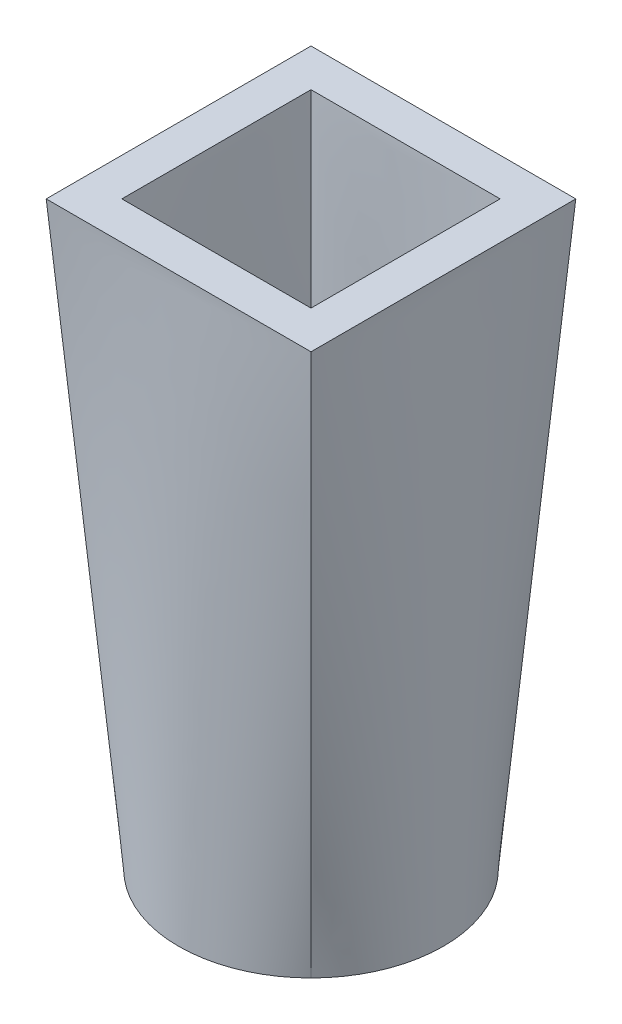
ISO-10303-21;
HEADER;
FILE_DESCRIPTION(('STEP AP214'),'2;1');
FILE_NAME('part.step','',(''),(''),'','','');
FILE_SCHEMA(('AUTOMOTIVE_DESIGN { 1 0 10303 214 1 1 1 1 }'));
ENDSEC;
DATA;
#1=APPLICATION_CONTEXT('core data for automotive mechanical design processes');
#2=APPLICATION_PROTOCOL_DEFINITION('international standard','automotive_design',2000,#1);
#3=PRODUCT_CONTEXT('',#1,'mechanical');
#4=PRODUCT('Part','Part','',(#3));
#5=PRODUCT_RELATED_PRODUCT_CATEGORY('part','',(#4));
#6=PRODUCT_DEFINITION_FORMATION('','',#4);
#7=PRODUCT_DEFINITION_CONTEXT('part definition',#1,'design');
#8=PRODUCT_DEFINITION('design','',#6,#7);
#9=PRODUCT_DEFINITION_SHAPE('','',#8);
#10=(LENGTH_UNIT() NAMED_UNIT(*) SI_UNIT(.MILLI.,.METRE.));
#11=(NAMED_UNIT(*) PLANE_ANGLE_UNIT() SI_UNIT($,.RADIAN.));
#12=(NAMED_UNIT(*) SI_UNIT($,.STERADIAN.) SOLID_ANGLE_UNIT());
#13=UNCERTAINTY_MEASURE_WITH_UNIT(LENGTH_MEASURE(1.E-05),#10,'distance_accuracy_value','');
#14=(GEOMETRIC_REPRESENTATION_CONTEXT(3) GLOBAL_UNCERTAINTY_ASSIGNED_CONTEXT((#13)) GLOBAL_UNIT_ASSIGNED_CONTEXT((#10,
#11,#12)) REPRESENTATION_CONTEXT('',''));
#15=CARTESIAN_POINT('',(0.,0.,0.));
#16=DIRECTION('',(0.,0.,1.));
#17=DIRECTION('',(1.,0.,0.));
#18=AXIS2_PLACEMENT_3D('',#15,#16,#17);
#19=CARTESIAN_POINT('',(0.,153.617019002257,0.));
#20=DIRECTION('',(0.,1.,0.));
#21=DIRECTION('',(0.,0.,1.));
#22=AXIS2_PLACEMENT_3D('',#19,#20,#21);
#23=PLANE('',#22);
#24=DIRECTION('',(1.,0.,0.));
#25=VECTOR('',#24,1.);
#26=CARTESIAN_POINT('',(-25.,153.617019002257,25.));
#27=LINE('',#26,#25);
#28=CARTESIAN_POINT('',(-25.,153.617019002257,25.));
#29=VERTEX_POINT('',#28);
#30=CARTESIAN_POINT('',(25.,153.617019002257,25.));
#31=VERTEX_POINT('',#30);
#32=EDGE_CURVE('E293',#29,#31,#27,.T.);
#33=ORIENTED_EDGE('',*,*,#32,.F.);
#34=DIRECTION('',(0.,0.,-1.));
#35=VECTOR('',#34,1.);
#36=CARTESIAN_POINT('',(-25.,153.617019002257,25.));
#37=LINE('',#36,#35);
#38=CARTESIAN_POINT('',(-25.,153.617019002257,-25.));
#39=VERTEX_POINT('',#38);
#40=EDGE_CURVE('E179',#29,#39,#37,.T.);
#41=ORIENTED_EDGE('',*,*,#40,.T.);
#42=DIRECTION('',(1.,0.,0.));
#43=VECTOR('',#42,1.);
#44=CARTESIAN_POINT('',(-25.,153.617019002257,-25.));
#45=LINE('',#44,#43);
#46=CARTESIAN_POINT('',(25.,153.617019002257,-25.));
#47=VERTEX_POINT('',#46);
#48=EDGE_CURVE('E265',#39,#47,#45,.T.);
#49=ORIENTED_EDGE('',*,*,#48,.T.);
#50=DIRECTION('',(0.,0.,-1.));
#51=VECTOR('',#50,1.);
#52=CARTESIAN_POINT('',(25.,153.617019002257,25.));
#53=LINE('',#52,#51);
#54=EDGE_CURVE('E95',#31,#47,#53,.T.);
#55=ORIENTED_EDGE('',*,*,#54,.F.);
#56=EDGE_LOOP('',(#33,#41,#49,#55));
#57=FACE_BOUND('',#56,.T.);
#58=DIRECTION('',(1.,0.,0.));
#59=VECTOR('',#58,1.);
#60=CARTESIAN_POINT('',(-35.,153.617019002257,35.));
#61=LINE('',#60,#59);
#62=CARTESIAN_POINT('',(-35.,153.617019002257,35.));
#63=VERTEX_POINT('',#62);
#64=CARTESIAN_POINT('',(35.,153.617019002257,35.));
#65=VERTEX_POINT('',#64);
#66=EDGE_CURVE('E172',#63,#65,#61,.T.);
#67=ORIENTED_EDGE('',*,*,#66,.T.);
#68=DIRECTION('',(0.,0.,-1.));
#69=VECTOR('',#68,1.);
#70=CARTESIAN_POINT('',(35.,153.617019002257,35.));
#71=LINE('',#70,#69);
#72=CARTESIAN_POINT('',(35.,153.617019002257,-35.));
#73=VERTEX_POINT('',#72);
#74=EDGE_CURVE('E395',#65,#73,#71,.T.);
#75=ORIENTED_EDGE('',*,*,#74,.T.);
#76=DIRECTION('',(1.,0.,0.));
#77=VECTOR('',#76,1.);
#78=CARTESIAN_POINT('',(-35.,153.617019002257,-35.));
#79=LINE('',#78,#77);
#80=CARTESIAN_POINT('',(-35.,153.617019002257,-35.));
#81=VERTEX_POINT('',#80);
#82=EDGE_CURVE('E422',#81,#73,#79,.T.);
#83=ORIENTED_EDGE('',*,*,#82,.F.);
#84=DIRECTION('',(0.,0.,-1.));
#85=VECTOR('',#84,1.);
#86=CARTESIAN_POINT('',(-35.,153.617019002257,35.));
#87=LINE('',#86,#85);
#88=EDGE_CURVE('E350',#63,#81,#87,.T.);
#89=ORIENTED_EDGE('',*,*,#88,.F.);
#90=EDGE_LOOP('',(#67,#75,#83,#89));
#91=FACE_BOUND('',#90,.T.);
#92=ADVANCED_FACE('F91',(#57,#91),#23,.T.);
#93=CARTESIAN_POINT('',(0.,0.,0.));
#94=DIRECTION('',(0.,1.,0.));
#95=DIRECTION('',(0.,0.,1.));
#96=AXIS2_PLACEMENT_3D('',#93,#94,#95);
#97=PLANE('',#96);
#98=CARTESIAN_POINT('',(0.,0.,0.));
#99=DIRECTION('',(0.,1.,0.));
#100=DIRECTION('',(0.,0.,1.));
#101=AXIS2_PLACEMENT_3D('',#98,#99,#100);
#102=CIRCLE('',#101,25.);
#103=CARTESIAN_POINT('',(-17.6776695296637,0.,-17.6776695296637));
#104=VERTEX_POINT('',#103);
#105=CARTESIAN_POINT('',(-17.6776695296637,0.,17.6776695296637));
#106=VERTEX_POINT('',#105);
#107=EDGE_CURVE('E117',#104,#106,#102,.T.);
#108=ORIENTED_EDGE('',*,*,#107,.T.);
#109=CARTESIAN_POINT('',(17.6776695296637,0.,17.6776695296637));
#110=VERTEX_POINT('',#109);
#111=EDGE_CURVE('E161',#106,#110,#102,.T.);
#112=ORIENTED_EDGE('',*,*,#111,.T.);
#113=CARTESIAN_POINT('',(17.6776695296637,0.,-17.6776695296637));
#114=VERTEX_POINT('',#113);
#115=EDGE_CURVE('E173',#110,#114,#102,.T.);
#116=ORIENTED_EDGE('',*,*,#115,.T.);
#117=EDGE_CURVE('E187',#114,#104,#102,.T.);
#118=ORIENTED_EDGE('',*,*,#117,.T.);
#119=EDGE_LOOP('',(#108,#112,#116,#118));
#120=FACE_BOUND('',#119,.T.);
#121=CARTESIAN_POINT('',(0.,0.,0.));
#122=DIRECTION('',(0.,1.,0.));
#123=DIRECTION('',(0.,0.,1.));
#124=AXIS2_PLACEMENT_3D('',#121,#122,#123);
#125=CIRCLE('',#124,35.);
#126=CARTESIAN_POINT('',(-24.7487373415292,0.,24.7487373415292));
#127=VERTEX_POINT('',#126);
#128=CARTESIAN_POINT('',(24.7487373415292,0.,24.7487373415292));
#129=VERTEX_POINT('',#128);
#130=EDGE_CURVE('E12',#127,#129,#125,.T.);
#131=ORIENTED_EDGE('',*,*,#130,.F.);
#132=CARTESIAN_POINT('',(-24.7487373415292,0.,-24.7487373415292));
#133=VERTEX_POINT('',#132);
#134=EDGE_CURVE('E320',#133,#127,#125,.T.);
#135=ORIENTED_EDGE('',*,*,#134,.F.);
#136=CARTESIAN_POINT('',(24.7487373415292,0.,-24.7487373415292));
#137=VERTEX_POINT('',#136);
#138=EDGE_CURVE('E321',#137,#133,#125,.T.);
#139=ORIENTED_EDGE('',*,*,#138,.F.);
#140=EDGE_CURVE('E101',#129,#137,#125,.T.);
#141=ORIENTED_EDGE('',*,*,#140,.F.);
#142=EDGE_LOOP('',(#131,#135,#139,#141));
#143=FACE_BOUND('',#142,.T.);
#144=ADVANCED_FACE('F185',(#120,#143),#97,.F.);
#145=CARTESIAN_POINT('',(-24.7487373415292,0.,24.7487373415292));
#146=CARTESIAN_POINT('',(-35.,153.617019002257,35.));
#147=CARTESIAN_POINT('',(-23.2904040081958,0.,26.2070706748625));
#148=CARTESIAN_POINT('',(-32.0833333333333,153.617019002257,35.));
#149=CARTESIAN_POINT('',(-21.6478916843896,0.,27.5902980372642));
#150=CARTESIAN_POINT('',(-29.1666666666667,153.617019002257,35.));
#151=CARTESIAN_POINT('',(-18.016529314503,0.,30.0875461216727));
#152=CARTESIAN_POINT('',(-23.3333333333333,153.617019002257,35.));
#153=CARTESIAN_POINT('',(-16.0274938237574,0.,31.20075829867));
#154=CARTESIAN_POINT('',(-20.4166666666666,153.617019002257,35.));
#155=CARTESIAN_POINT('',(-11.7749205011776,0.,33.041173161278));
#156=CARTESIAN_POINT('',(-14.5833333333333,153.617019002257,35.));
#157=CARTESIAN_POINT('',(-9.51171560693949,0.,33.7674737720229));
#158=CARTESIAN_POINT('',(-11.6666666666666,153.617019002257,35.));
#159=CARTESIAN_POINT('',(-4.83194760493549,0.,34.7471912688595));
#160=CARTESIAN_POINT('',(-5.8333333333333,153.617019002257,35.));
#161=CARTESIAN_POINT('',(-2.41624578050973,0.,35.));
#162=CARTESIAN_POINT('',(-2.91666666666664,153.617019002257,35.));
#163=CARTESIAN_POINT('',(2.41624578050972,0.,35.));
#164=CARTESIAN_POINT('',(2.9166666666667,153.617019002257,35.));
#165=CARTESIAN_POINT('',(4.83194760493548,0.,34.7471912688595));
#166=CARTESIAN_POINT('',(5.83333333333337,153.617019002257,35.));
#167=CARTESIAN_POINT('',(9.51171560693949,0.,33.7674737720229));
#168=CARTESIAN_POINT('',(11.6666666666667,153.617019002257,35.));
#169=CARTESIAN_POINT('',(11.7749205011775,0.,33.041173161278));
#170=CARTESIAN_POINT('',(14.5833333333334,153.617019002257,35.));
#171=CARTESIAN_POINT('',(16.0274938237574,0.,31.20075829867));
#172=CARTESIAN_POINT('',(20.4166666666667,153.617019002257,35.));
#173=CARTESIAN_POINT('',(18.016529314503,0.,30.0875461216727));
#174=CARTESIAN_POINT('',(23.3333333333334,153.617019002257,35.));
#175=CARTESIAN_POINT('',(21.6478916843896,0.,27.5902980372642));
#176=CARTESIAN_POINT('',(29.1666666666667,153.617019002257,35.));
#177=CARTESIAN_POINT('',(23.2904040081958,0.,26.2070706748625));
#178=CARTESIAN_POINT('',(32.0833333333333,153.617019002257,35.));
#179=CARTESIAN_POINT('',(24.7487373415292,0.,24.7487373415292));
#180=CARTESIAN_POINT('',(35.,153.617019002257,35.));
#181=B_SPLINE_SURFACE_WITH_KNOTS('',3,1,((#145,#146),(#147,#148),(#149,#150),(#151,#152),(#153,
#154),(#155,#156),(#157,#158),(#159,#160),(#161,#162),(#163,#164),(#165,#166),(#167,#168),(#169,
#170),(#171,#172),(#173,#174),(#175,#176),(#177,#178),(#179,#180)),.UNSPECIFIED.,.F.,.F.,.F.,(4,
2,2,2,2,2,2,2,4),(2,2),(0.,0.125,0.25,0.375,0.5,0.625,0.75,0.875,1.),(0.,1.),.UNSPECIFIED.);
#182=DIRECTION('',(0.0664373914767899,0.995576288401607,0.0664373914767898));
#183=VECTOR('',#182,1.);
#184=CARTESIAN_POINT('',(29.8743686707646,76.8085095011283,29.8743686707646));
#185=LINE('',#184,#183);
#186=EDGE_CURVE('E330',#129,#65,#185,.T.);
#187=DIRECTION('',(0.0664373914767897,-0.995576288401607,-0.0664373914767899));
#188=VECTOR('',#187,1.);
#189=CARTESIAN_POINT('',(-29.8743686707646,76.8085095011283,29.8743686707646));
#190=LINE('',#189,#188);
#191=EDGE_CURVE('E336',#63,#127,#190,.T.);
#192=ORIENTED_EDGE('',*,*,#130,.T.);
#193=ORIENTED_EDGE('',*,*,#186,.T.);
#194=ORIENTED_EDGE('',*,*,#66,.F.);
#195=ORIENTED_EDGE('',*,*,#191,.T.);
#196=EDGE_LOOP('',(#192,#193,#194,#195));
#197=FACE_BOUND('',#196,.T.);
#198=ADVANCED_FACE('F208',(#197),#181,.T.);
#199=CARTESIAN_POINT('',(24.7487373415292,0.,24.7487373415292));
#200=CARTESIAN_POINT('',(35.,153.617019002257,35.));
#201=CARTESIAN_POINT('',(26.2070706748625,0.,23.2904040081958));
#202=CARTESIAN_POINT('',(35.,153.617019002257,32.0833333333333));
#203=CARTESIAN_POINT('',(27.5902980372642,0.,21.6478916843896));
#204=CARTESIAN_POINT('',(35.,153.617019002257,29.1666666666667));
#205=CARTESIAN_POINT('',(30.0875461216727,0.,18.016529314503));
#206=CARTESIAN_POINT('',(35.,153.617019002257,23.3333333333333));
#207=CARTESIAN_POINT('',(31.20075829867,0.,16.0274938237574));
#208=CARTESIAN_POINT('',(35.,153.617019002257,20.4166666666667));
#209=CARTESIAN_POINT('',(33.041173161278,0.,11.7749205011775));
#210=CARTESIAN_POINT('',(35.,153.617019002257,14.5833333333333));
#211=CARTESIAN_POINT('',(33.7674737720229,0.,9.51171560693949));
#212=CARTESIAN_POINT('',(35.,153.617019002257,11.6666666666666));
#213=CARTESIAN_POINT('',(34.7471912688595,0.,4.83194760493549));
#214=CARTESIAN_POINT('',(35.,153.617019002257,5.83333333333331));
#215=CARTESIAN_POINT('',(35.,0.,2.41624578050972));
#216=CARTESIAN_POINT('',(35.,153.617019002257,2.91666666666664));
#217=CARTESIAN_POINT('',(35.,0.,-2.41624578050972));
#218=CARTESIAN_POINT('',(35.,153.617019002257,-2.91666666666669));
#219=CARTESIAN_POINT('',(34.7471912688595,0.,-4.83194760493548));
#220=CARTESIAN_POINT('',(35.,153.617019002257,-5.83333333333336));
#221=CARTESIAN_POINT('',(33.7674737720228,0.,-9.51171560693948));
#222=CARTESIAN_POINT('',(35.,153.617019002257,-11.6666666666667));
#223=CARTESIAN_POINT('',(33.041173161278,0.,-11.7749205011775));
#224=CARTESIAN_POINT('',(35.,153.617019002257,-14.5833333333334));
#225=CARTESIAN_POINT('',(31.20075829867,0.,-16.0274938237574));
#226=CARTESIAN_POINT('',(35.,153.617019002257,-20.4166666666667));
#227=CARTESIAN_POINT('',(30.0875461216727,0.,-18.016529314503));
#228=CARTESIAN_POINT('',(35.,153.617019002257,-23.3333333333334));
#229=CARTESIAN_POINT('',(27.5902980372642,0.,-21.6478916843896));
#230=CARTESIAN_POINT('',(35.,153.617019002257,-29.1666666666667));
#231=CARTESIAN_POINT('',(26.2070706748625,0.,-23.2904040081958));
#232=CARTESIAN_POINT('',(35.,153.617019002257,-32.0833333333333));
#233=CARTESIAN_POINT('',(24.7487373415292,0.,-24.7487373415292));
#234=CARTESIAN_POINT('',(35.,153.617019002257,-35.));
#235=B_SPLINE_SURFACE_WITH_KNOTS('',3,1,((#199,#200),(#201,#202),(#203,#204),(#205,#206),(#207,
#208),(#209,#210),(#211,#212),(#213,#214),(#215,#216),(#217,#218),(#219,#220),(#221,#222),(#223,
#224),(#225,#226),(#227,#228),(#229,#230),(#231,#232),(#233,#234)),.UNSPECIFIED.,.F.,.F.,.F.,(4,
2,2,2,2,2,2,2,4),(2,2),(0.,0.125,0.25,0.375,0.5,0.625,0.75,0.875,1.),(0.,1.),.UNSPECIFIED.);
#236=DIRECTION('',(0.0664373914767899,0.995576288401607,-0.0664373914767898));
#237=VECTOR('',#236,1.);
#238=CARTESIAN_POINT('',(29.8743686707646,76.8085095011283,-29.8743686707646));
#239=LINE('',#238,#237);
#240=EDGE_CURVE('E341',#137,#73,#239,.T.);
#241=ORIENTED_EDGE('',*,*,#140,.T.);
#242=ORIENTED_EDGE('',*,*,#240,.T.);
#243=ORIENTED_EDGE('',*,*,#74,.F.);
#244=ORIENTED_EDGE('',*,*,#186,.F.);
#245=EDGE_LOOP('',(#241,#242,#243,#244));
#246=FACE_BOUND('',#245,.T.);
#247=ADVANCED_FACE('F369',(#246),#235,.T.);
#248=CARTESIAN_POINT('',(-24.7487373415292,0.,-24.7487373415292));
#249=CARTESIAN_POINT('',(-35.,153.617019002257,-35.));
#250=CARTESIAN_POINT('',(-26.2070706748625,0.,-23.2904040081958));
#251=CARTESIAN_POINT('',(-35.,153.617019002257,-32.0833333333333));
#252=CARTESIAN_POINT('',(-27.5902980372642,0.,-21.6478916843896));
#253=CARTESIAN_POINT('',(-35.,153.617019002257,-29.1666666666667));
#254=CARTESIAN_POINT('',(-30.0875461216727,0.,-18.016529314503));
#255=CARTESIAN_POINT('',(-35.,153.617019002257,-23.3333333333333));
#256=CARTESIAN_POINT('',(-31.20075829867,0.,-16.0274938237574));
#257=CARTESIAN_POINT('',(-35.,153.617019002257,-20.4166666666666));
#258=CARTESIAN_POINT('',(-33.041173161278,0.,-11.7749205011776));
#259=CARTESIAN_POINT('',(-35.,153.617019002257,-14.5833333333333));
#260=CARTESIAN_POINT('',(-33.7674737720229,0.,-9.51171560693949));
#261=CARTESIAN_POINT('',(-35.,153.617019002257,-11.6666666666666));
#262=CARTESIAN_POINT('',(-34.7471912688595,0.,-4.83194760493549));
#263=CARTESIAN_POINT('',(-35.,153.617019002257,-5.83333333333331));
#264=CARTESIAN_POINT('',(-35.,0.,-2.41624578050973));
#265=CARTESIAN_POINT('',(-35.,153.617019002257,-2.91666666666665));
#266=CARTESIAN_POINT('',(-35.,0.,2.41624578050971));
#267=CARTESIAN_POINT('',(-35.,153.617019002257,2.91666666666669));
#268=CARTESIAN_POINT('',(-34.7471912688595,0.,4.83194760493548));
#269=CARTESIAN_POINT('',(-35.,153.617019002257,5.83333333333336));
#270=CARTESIAN_POINT('',(-33.7674737720228,0.,9.51171560693948));
#271=CARTESIAN_POINT('',(-35.,153.617019002257,11.6666666666667));
#272=CARTESIAN_POINT('',(-33.041173161278,0.,11.7749205011775));
#273=CARTESIAN_POINT('',(-35.,153.617019002257,14.5833333333334));
#274=CARTESIAN_POINT('',(-31.20075829867,0.,16.0274938237574));
#275=CARTESIAN_POINT('',(-35.,153.617019002257,20.4166666666667));
#276=CARTESIAN_POINT('',(-30.0875461216727,0.,18.016529314503));
#277=CARTESIAN_POINT('',(-35.,153.617019002257,23.3333333333334));
#278=CARTESIAN_POINT('',(-27.5902980372642,0.,21.6478916843896));
#279=CARTESIAN_POINT('',(-35.,153.617019002257,29.1666666666667));
#280=CARTESIAN_POINT('',(-26.2070706748625,0.,23.2904040081958));
#281=CARTESIAN_POINT('',(-35.,153.617019002257,32.0833333333333));
#282=CARTESIAN_POINT('',(-24.7487373415292,0.,24.7487373415292));
#283=CARTESIAN_POINT('',(-35.,153.617019002257,35.));
#284=B_SPLINE_SURFACE_WITH_KNOTS('',3,1,((#248,#249),(#250,#251),(#252,#253),(#254,#255),(#256,
#257),(#258,#259),(#260,#261),(#262,#263),(#264,#265),(#266,#267),(#268,#269),(#270,#271),(#272,
#273),(#274,#275),(#276,#277),(#278,#279),(#280,#281),(#282,#283)),.UNSPECIFIED.,.F.,.F.,.F.,(4,
2,2,2,2,2,2,2,4),(2,2),(0.,0.125,0.25,0.375,0.5,0.625,0.75,0.875,1.),(0.,1.),.UNSPECIFIED.);
#285=DIRECTION('',(-0.0664373914767898,0.995576288401607,-0.0664373914767898));
#286=VECTOR('',#285,1.);
#287=CARTESIAN_POINT('',(-29.8743686707646,76.8085095011283,-29.8743686707646));
#288=LINE('',#287,#286);
#289=EDGE_CURVE('E356',#133,#81,#288,.T.);
#290=ORIENTED_EDGE('',*,*,#134,.T.);
#291=ORIENTED_EDGE('',*,*,#191,.F.);
#292=ORIENTED_EDGE('',*,*,#88,.T.);
#293=ORIENTED_EDGE('',*,*,#289,.F.);
#294=EDGE_LOOP('',(#290,#291,#292,#293));
#295=FACE_BOUND('',#294,.T.);
#296=ADVANCED_FACE('F358',(#295),#284,.T.);
#297=CARTESIAN_POINT('',(24.7487373415292,0.,-24.7487373415292));
#298=CARTESIAN_POINT('',(35.,153.617019002257,-35.));
#299=CARTESIAN_POINT('',(23.2904040081958,0.,-26.2070706748625));
#300=CARTESIAN_POINT('',(32.0833333333333,153.617019002257,-35.));
#301=CARTESIAN_POINT('',(21.6478916843896,0.,-27.5902980372642));
#302=CARTESIAN_POINT('',(29.1666666666667,153.617019002257,-35.));
#303=CARTESIAN_POINT('',(18.016529314503,0.,-30.0875461216727));
#304=CARTESIAN_POINT('',(23.3333333333333,153.617019002257,-35.));
#305=CARTESIAN_POINT('',(16.0274938237574,0.,-31.20075829867));
#306=CARTESIAN_POINT('',(20.4166666666667,153.617019002257,-35.));
#307=CARTESIAN_POINT('',(11.7749205011776,0.,-33.041173161278));
#308=CARTESIAN_POINT('',(14.5833333333333,153.617019002257,-35.));
#309=CARTESIAN_POINT('',(9.51171560693949,0.,-33.7674737720229));
#310=CARTESIAN_POINT('',(11.6666666666667,153.617019002257,-35.));
#311=CARTESIAN_POINT('',(4.83194760493549,0.,-34.7471912688595));
#312=CARTESIAN_POINT('',(5.83333333333334,153.617019002257,-35.));
#313=CARTESIAN_POINT('',(2.41624578050973,0.,-35.));
#314=CARTESIAN_POINT('',(2.91666666666668,153.617019002257,-35.));
#315=CARTESIAN_POINT('',(-2.41624578050972,0.,-35.));
#316=CARTESIAN_POINT('',(-2.91666666666666,153.617019002257,-35.));
#317=CARTESIAN_POINT('',(-4.83194760493548,0.,-34.7471912688595));
#318=CARTESIAN_POINT('',(-5.83333333333333,153.617019002257,-35.));
#319=CARTESIAN_POINT('',(-9.51171560693949,0.,-33.7674737720229));
#320=CARTESIAN_POINT('',(-11.6666666666667,153.617019002257,-35.));
#321=CARTESIAN_POINT('',(-11.7749205011775,0.,-33.041173161278));
#322=CARTESIAN_POINT('',(-14.5833333333333,153.617019002257,-35.));
#323=CARTESIAN_POINT('',(-16.0274938237574,0.,-31.20075829867));
#324=CARTESIAN_POINT('',(-20.4166666666667,153.617019002257,-35.));
#325=CARTESIAN_POINT('',(-18.016529314503,0.,-30.0875461216727));
#326=CARTESIAN_POINT('',(-23.3333333333333,153.617019002257,-35.));
#327=CARTESIAN_POINT('',(-21.6478916843896,0.,-27.5902980372642));
#328=CARTESIAN_POINT('',(-29.1666666666667,153.617019002257,-35.));
#329=CARTESIAN_POINT('',(-23.2904040081958,0.,-26.2070706748625));
#330=CARTESIAN_POINT('',(-32.0833333333333,153.617019002257,-35.));
#331=CARTESIAN_POINT('',(-24.7487373415292,0.,-24.7487373415292));
#332=CARTESIAN_POINT('',(-35.,153.617019002257,-35.));
#333=B_SPLINE_SURFACE_WITH_KNOTS('',3,1,((#297,#298),(#299,#300),(#301,#302),(#303,#304),(#305,
#306),(#307,#308),(#309,#310),(#311,#312),(#313,#314),(#315,#316),(#317,#318),(#319,#320),(#321,
#322),(#323,#324),(#325,#326),(#327,#328),(#329,#330),(#331,#332)),.UNSPECIFIED.,.F.,.F.,.F.,(4,
2,2,2,2,2,2,2,4),(2,2),(0.,0.125,0.25,0.375,0.5,0.625,0.75,0.875,1.),(0.,1.),.UNSPECIFIED.);
#334=ORIENTED_EDGE('',*,*,#138,.T.);
#335=ORIENTED_EDGE('',*,*,#289,.T.);
#336=ORIENTED_EDGE('',*,*,#82,.T.);
#337=ORIENTED_EDGE('',*,*,#240,.F.);
#338=EDGE_LOOP('',(#334,#335,#336,#337));
#339=FACE_BOUND('',#338,.T.);
#340=ADVANCED_FACE('F368',(#339),#333,.T.);
#341=CARTESIAN_POINT('',(-17.6776695296637,0.,17.6776695296637));
#342=CARTESIAN_POINT('',(-25.,153.617019002257,25.));
#343=CARTESIAN_POINT('',(-16.636002862997,0.,18.7193361963304));
#344=CARTESIAN_POINT('',(-22.9166666666667,153.617019002257,25.));
#345=CARTESIAN_POINT('',(-15.462779774564,0.,19.707355740903));
#346=CARTESIAN_POINT('',(-20.8333333333333,153.617019002257,25.));
#347=CARTESIAN_POINT('',(-12.8689495103593,0.,21.4911043726234));
#348=CARTESIAN_POINT('',(-16.6666666666667,153.617019002257,25.));
#349=CARTESIAN_POINT('',(-11.4482098741124,0.,22.2862559276214));
#350=CARTESIAN_POINT('',(-14.5833333333334,153.617019002257,25.));
#351=CARTESIAN_POINT('',(-8.41065750084111,0.,23.6008379723414));
#352=CARTESIAN_POINT('',(-10.4166666666667,153.617019002257,25.));
#353=CARTESIAN_POINT('',(-6.79408257638535,0.,24.1196241228735));
#354=CARTESIAN_POINT('',(-8.33333333333339,153.617019002257,25.));
#355=CARTESIAN_POINT('',(-3.45139114638249,0.,24.8194223348996));
#356=CARTESIAN_POINT('',(-4.16666666666673,153.617019002257,25.));
#357=CARTESIAN_POINT('',(-1.72588984322123,0.,25.));
#358=CARTESIAN_POINT('',(-2.0833333333334,153.617019002257,25.));
#359=CARTESIAN_POINT('',(1.72588984322123,0.,25.));
#360=CARTESIAN_POINT('',(2.08333333333326,153.617019002257,25.));
#361=CARTESIAN_POINT('',(3.45139114638249,0.,24.8194223348996));
#362=CARTESIAN_POINT('',(4.1666666666666,153.617019002257,25.));
#363=CARTESIAN_POINT('',(6.79408257638534,0.,24.1196241228735));
#364=CARTESIAN_POINT('',(8.33333333333327,153.617019002257,25.));
#365=CARTESIAN_POINT('',(8.4106575008411,0.,23.6008379723414));
#366=CARTESIAN_POINT('',(10.4166666666666,153.617019002257,25.));
#367=CARTESIAN_POINT('',(11.4482098741124,0.,22.2862559276214));
#368=CARTESIAN_POINT('',(14.5833333333333,153.617019002257,25.));
#369=CARTESIAN_POINT('',(12.8689495103593,0.,21.4911043726234));
#370=CARTESIAN_POINT('',(16.6666666666666,153.617019002257,25.));
#371=CARTESIAN_POINT('',(15.462779774564,0.,19.707355740903));
#372=CARTESIAN_POINT('',(20.8333333333333,153.617019002257,25.));
#373=CARTESIAN_POINT('',(16.636002862997,0.,18.7193361963304));
#374=CARTESIAN_POINT('',(22.9166666666667,153.617019002257,25.));
#375=CARTESIAN_POINT('',(17.6776695296637,0.,17.6776695296637));
#376=CARTESIAN_POINT('',(25.,153.617019002257,25.));
#377=B_SPLINE_SURFACE_WITH_KNOTS('',3,1,((#341,#342),(#343,#344),(#345,#346),(#347,#348),(#349,
#350),(#351,#352),(#353,#354),(#355,#356),(#357,#358),(#359,#360),(#361,#362),(#363,#364),(#365,
#366),(#367,#368),(#369,#370),(#371,#372),(#373,#374),(#375,#376)),.UNSPECIFIED.,.F.,.F.,.F.,(4,
2,2,2,2,2,2,2,4),(2,2),(0.,0.125,0.25,0.375,0.5,0.625,0.75,0.875,1.),(0.,1.),.UNSPECIFIED.);
#378=DIRECTION('',(0.0475582082129059,-0.997735653198359,-0.047558208212906));
#379=VECTOR('',#378,1.);
#380=CARTESIAN_POINT('',(-21.3388347648318,76.8085095011283,21.3388347648318));
#381=LINE('',#380,#379);
#382=EDGE_CURVE('E164',#29,#106,#381,.T.);
#383=DIRECTION('',(0.0475582082129059,0.997735653198359,0.047558208212906));
#384=VECTOR('',#383,1.);
#385=CARTESIAN_POINT('',(21.3388347648319,76.8085095011283,21.3388347648318));
#386=LINE('',#385,#384);
#387=EDGE_CURVE('E167',#110,#31,#386,.T.);
#388=ORIENTED_EDGE('',*,*,#111,.F.);
#389=ORIENTED_EDGE('',*,*,#382,.F.);
#390=ORIENTED_EDGE('',*,*,#32,.T.);
#391=ORIENTED_EDGE('',*,*,#387,.F.);
#392=EDGE_LOOP('',(#388,#389,#390,#391));
#393=FACE_BOUND('',#392,.T.);
#394=ADVANCED_FACE('F163',(#393),#377,.F.);
#395=CARTESIAN_POINT('',(17.6776695296637,0.,17.6776695296637));
#396=CARTESIAN_POINT('',(25.,153.617019002257,25.));
#397=CARTESIAN_POINT('',(18.7193361963304,0.,16.636002862997));
#398=CARTESIAN_POINT('',(25.,153.617019002257,22.9166666666667));
#399=CARTESIAN_POINT('',(19.707355740903,0.,15.462779774564));
#400=CARTESIAN_POINT('',(25.,153.617019002257,20.8333333333333));
#401=CARTESIAN_POINT('',(21.4911043726234,0.,12.8689495103593));
#402=CARTESIAN_POINT('',(25.,153.617019002257,16.6666666666667));
#403=CARTESIAN_POINT('',(22.2862559276214,0.,11.4482098741124));
#404=CARTESIAN_POINT('',(25.,153.617019002257,14.5833333333333));
#405=CARTESIAN_POINT('',(23.6008379723414,0.,8.4106575008411));
#406=CARTESIAN_POINT('',(25.,153.617019002257,10.4166666666667));
#407=CARTESIAN_POINT('',(24.1196241228735,0.,6.79408257638535));
#408=CARTESIAN_POINT('',(25.,153.617019002257,8.33333333333335));
#409=CARTESIAN_POINT('',(24.8194223348996,0.,3.45139114638249));
#410=CARTESIAN_POINT('',(25.,153.617019002257,4.16666666666668));
#411=CARTESIAN_POINT('',(25.,0.,1.72588984322123));
#412=CARTESIAN_POINT('',(25.,153.617019002257,2.08333333333335));
#413=CARTESIAN_POINT('',(25.,0.,-1.72588984322123));
#414=CARTESIAN_POINT('',(25.,153.617019002257,-2.08333333333332));
#415=CARTESIAN_POINT('',(24.8194223348996,0.,-3.45139114638249));
#416=CARTESIAN_POINT('',(25.,153.617019002257,-4.16666666666665));
#417=CARTESIAN_POINT('',(24.1196241228735,0.,-6.79408257638534));
#418=CARTESIAN_POINT('',(25.,153.617019002257,-8.33333333333332));
#419=CARTESIAN_POINT('',(23.6008379723414,0.,-8.4106575008411));
#420=CARTESIAN_POINT('',(25.,153.617019002257,-10.4166666666667));
#421=CARTESIAN_POINT('',(22.2862559276214,0.,-11.4482098741124));
#422=CARTESIAN_POINT('',(25.,153.617019002257,-14.5833333333333));
#423=CARTESIAN_POINT('',(21.4911043726234,0.,-12.8689495103593));
#424=CARTESIAN_POINT('',(25.,153.617019002257,-16.6666666666667));
#425=CARTESIAN_POINT('',(19.707355740903,0.,-15.462779774564));
#426=CARTESIAN_POINT('',(25.,153.617019002257,-20.8333333333333));
#427=CARTESIAN_POINT('',(18.7193361963304,0.,-16.636002862997));
#428=CARTESIAN_POINT('',(25.,153.617019002257,-22.9166666666667));
#429=CARTESIAN_POINT('',(17.6776695296637,0.,-17.6776695296637));
#430=CARTESIAN_POINT('',(25.,153.617019002257,-25.));
#431=B_SPLINE_SURFACE_WITH_KNOTS('',3,1,((#395,#396),(#397,#398),(#399,#400),(#401,#402),(#403,
#404),(#405,#406),(#407,#408),(#409,#410),(#411,#412),(#413,#414),(#415,#416),(#417,#418),(#419,
#420),(#421,#422),(#423,#424),(#425,#426),(#427,#428),(#429,#430)),.UNSPECIFIED.,.F.,.F.,.F.,(4,
2,2,2,2,2,2,2,4),(2,2),(0.,0.125,0.25,0.375,0.5,0.625,0.75,0.875,1.),(0.,1.),.UNSPECIFIED.);
#432=DIRECTION('',(0.047558208212906,0.997735653198359,-0.0475582082129059));
#433=VECTOR('',#432,1.);
#434=CARTESIAN_POINT('',(21.3388347648318,76.8085095011283,-21.3388347648318));
#435=LINE('',#434,#433);
#436=EDGE_CURVE('E109',#114,#47,#435,.T.);
#437=ORIENTED_EDGE('',*,*,#115,.F.);
#438=ORIENTED_EDGE('',*,*,#387,.T.);
#439=ORIENTED_EDGE('',*,*,#54,.T.);
#440=ORIENTED_EDGE('',*,*,#436,.F.);
#441=EDGE_LOOP('',(#437,#438,#439,#440));
#442=FACE_BOUND('',#441,.T.);
#443=ADVANCED_FACE('F450',(#442),#431,.F.);
#444=CARTESIAN_POINT('',(-17.6776695296637,0.,-17.6776695296637));
#445=CARTESIAN_POINT('',(-25.,153.617019002257,-25.));
#446=CARTESIAN_POINT('',(-18.7193361963304,0.,-16.636002862997));
#447=CARTESIAN_POINT('',(-25.,153.617019002257,-22.9166666666667));
#448=CARTESIAN_POINT('',(-19.707355740903,0.,-15.462779774564));
#449=CARTESIAN_POINT('',(-25.,153.617019002257,-20.8333333333333));
#450=CARTESIAN_POINT('',(-21.4911043726234,0.,-12.8689495103593));
#451=CARTESIAN_POINT('',(-25.,153.617019002257,-16.6666666666667));
#452=CARTESIAN_POINT('',(-22.2862559276214,0.,-11.4482098741124));
#453=CARTESIAN_POINT('',(-25.,153.617019002257,-14.5833333333333));
#454=CARTESIAN_POINT('',(-23.6008379723414,0.,-8.41065750084111));
#455=CARTESIAN_POINT('',(-25.,153.617019002257,-10.4166666666667));
#456=CARTESIAN_POINT('',(-24.1196241228735,0.,-6.79408257638535));
#457=CARTESIAN_POINT('',(-25.,153.617019002257,-8.33333333333333));
#458=CARTESIAN_POINT('',(-24.8194223348996,0.,-3.45139114638249));
#459=CARTESIAN_POINT('',(-25.,153.617019002257,-4.16666666666666));
#460=CARTESIAN_POINT('',(-25.,0.,-1.72588984322123));
#461=CARTESIAN_POINT('',(-25.,153.617019002257,-2.08333333333333));
#462=CARTESIAN_POINT('',(-25.,0.,1.72588984322123));
#463=CARTESIAN_POINT('',(-25.,153.617019002257,2.08333333333333));
#464=CARTESIAN_POINT('',(-24.8194223348996,0.,3.45139114638249));
#465=CARTESIAN_POINT('',(-25.,153.617019002257,4.16666666666667));
#466=CARTESIAN_POINT('',(-24.1196241228735,0.,6.79408257638534));
#467=CARTESIAN_POINT('',(-25.,153.617019002257,8.33333333333334));
#468=CARTESIAN_POINT('',(-23.6008379723414,0.,8.4106575008411));
#469=CARTESIAN_POINT('',(-25.,153.617019002257,10.4166666666667));
#470=CARTESIAN_POINT('',(-22.2862559276214,0.,11.4482098741124));
#471=CARTESIAN_POINT('',(-25.,153.617019002257,14.5833333333333));
#472=CARTESIAN_POINT('',(-21.4911043726234,0.,12.8689495103593));
#473=CARTESIAN_POINT('',(-25.,153.617019002257,16.6666666666667));
#474=CARTESIAN_POINT('',(-19.707355740903,0.,15.462779774564));
#475=CARTESIAN_POINT('',(-25.,153.617019002257,20.8333333333333));
#476=CARTESIAN_POINT('',(-18.7193361963304,0.,16.636002862997));
#477=CARTESIAN_POINT('',(-25.,153.617019002257,22.9166666666667));
#478=CARTESIAN_POINT('',(-17.6776695296637,0.,17.6776695296637));
#479=CARTESIAN_POINT('',(-25.,153.617019002257,25.));
#480=B_SPLINE_SURFACE_WITH_KNOTS('',3,1,((#444,#445),(#446,#447),(#448,#449),(#450,#451),(#452,
#453),(#454,#455),(#456,#457),(#458,#459),(#460,#461),(#462,#463),(#464,#465),(#466,#467),(#468,
#469),(#470,#471),(#472,#473),(#474,#475),(#476,#477),(#478,#479)),.UNSPECIFIED.,.F.,.F.,.F.,(4,
2,2,2,2,2,2,2,4),(2,2),(0.,0.125,0.25,0.375,0.5,0.625,0.75,0.875,1.),(0.,1.),.UNSPECIFIED.);
#481=DIRECTION('',(-0.0475582082129059,0.997735653198359,-0.0475582082129059));
#482=VECTOR('',#481,1.);
#483=CARTESIAN_POINT('',(-21.3388347648318,76.8085095011283,-21.3388347648318));
#484=LINE('',#483,#482);
#485=EDGE_CURVE('E511',#104,#39,#484,.T.);
#486=ORIENTED_EDGE('',*,*,#107,.F.);
#487=ORIENTED_EDGE('',*,*,#485,.T.);
#488=ORIENTED_EDGE('',*,*,#40,.F.);
#489=ORIENTED_EDGE('',*,*,#382,.T.);
#490=EDGE_LOOP('',(#486,#487,#488,#489));
#491=FACE_BOUND('',#490,.T.);
#492=ADVANCED_FACE('F177',(#491),#480,.F.);
#493=CARTESIAN_POINT('',(17.6776695296637,0.,-17.6776695296637));
#494=CARTESIAN_POINT('',(25.,153.617019002257,-25.));
#495=CARTESIAN_POINT('',(16.636002862997,0.,-18.7193361963304));
#496=CARTESIAN_POINT('',(22.9166666666667,153.617019002257,-25.));
#497=CARTESIAN_POINT('',(15.462779774564,0.,-19.707355740903));
#498=CARTESIAN_POINT('',(20.8333333333333,153.617019002257,-25.));
#499=CARTESIAN_POINT('',(12.8689495103593,0.,-21.4911043726234));
#500=CARTESIAN_POINT('',(16.6666666666667,153.617019002257,-25.));
#501=CARTESIAN_POINT('',(11.4482098741124,0.,-22.2862559276214));
#502=CARTESIAN_POINT('',(14.5833333333333,153.617019002257,-25.));
#503=CARTESIAN_POINT('',(8.4106575008411,0.,-23.6008379723414));
#504=CARTESIAN_POINT('',(10.4166666666667,153.617019002257,-25.));
#505=CARTESIAN_POINT('',(6.79408257638535,0.,-24.1196241228735));
#506=CARTESIAN_POINT('',(8.33333333333332,153.617019002257,-25.));
#507=CARTESIAN_POINT('',(3.45139114638249,0.,-24.8194223348996));
#508=CARTESIAN_POINT('',(4.16666666666665,153.617019002257,-25.));
#509=CARTESIAN_POINT('',(1.72588984322123,0.,-25.));
#510=CARTESIAN_POINT('',(2.08333333333332,153.617019002257,-25.));
#511=CARTESIAN_POINT('',(-1.72588984322123,0.,-25.));
#512=CARTESIAN_POINT('',(-2.08333333333335,153.617019002257,-25.));
#513=CARTESIAN_POINT('',(-3.45139114638249,0.,-24.8194223348996));
#514=CARTESIAN_POINT('',(-4.16666666666668,153.617019002257,-25.));
#515=CARTESIAN_POINT('',(-6.79408257638534,0.,-24.1196241228735));
#516=CARTESIAN_POINT('',(-8.33333333333334,153.617019002257,-25.));
#517=CARTESIAN_POINT('',(-8.4106575008411,0.,-23.6008379723414));
#518=CARTESIAN_POINT('',(-10.4166666666667,153.617019002257,-25.));
#519=CARTESIAN_POINT('',(-11.4482098741124,0.,-22.2862559276214));
#520=CARTESIAN_POINT('',(-14.5833333333333,153.617019002257,-25.));
#521=CARTESIAN_POINT('',(-12.8689495103593,0.,-21.4911043726234));
#522=CARTESIAN_POINT('',(-16.6666666666667,153.617019002257,-25.));
#523=CARTESIAN_POINT('',(-15.462779774564,0.,-19.707355740903));
#524=CARTESIAN_POINT('',(-20.8333333333333,153.617019002257,-25.));
#525=CARTESIAN_POINT('',(-16.636002862997,0.,-18.7193361963304));
#526=CARTESIAN_POINT('',(-22.9166666666667,153.617019002257,-25.));
#527=CARTESIAN_POINT('',(-17.6776695296637,0.,-17.6776695296637));
#528=CARTESIAN_POINT('',(-25.,153.617019002257,-25.));
#529=B_SPLINE_SURFACE_WITH_KNOTS('',3,1,((#493,#494),(#495,#496),(#497,#498),(#499,#500),(#501,
#502),(#503,#504),(#505,#506),(#507,#508),(#509,#510),(#511,#512),(#513,#514),(#515,#516),(#517,
#518),(#519,#520),(#521,#522),(#523,#524),(#525,#526),(#527,#528)),.UNSPECIFIED.,.F.,.F.,.F.,(4,
2,2,2,2,2,2,2,4),(2,2),(0.,0.125,0.25,0.375,0.5,0.625,0.75,0.875,1.),(0.,1.),.UNSPECIFIED.);
#530=ORIENTED_EDGE('',*,*,#117,.F.);
#531=ORIENTED_EDGE('',*,*,#436,.T.);
#532=ORIENTED_EDGE('',*,*,#48,.F.);
#533=ORIENTED_EDGE('',*,*,#485,.F.);
#534=EDGE_LOOP('',(#530,#531,#532,#533));
#535=FACE_BOUND('',#534,.T.);
#536=ADVANCED_FACE('F209',(#535),#529,.F.);
#537=CLOSED_SHELL('',(#92,#144,#198,#247,#296,#340,#394,#443,#492,#536));
#538=MANIFOLD_SOLID_BREP('B2',#537);
#539=ADVANCED_BREP_SHAPE_REPRESENTATION('',(#18,#538),#14);
#540=SHAPE_DEFINITION_REPRESENTATION(#9,#539);
ENDSEC;
END-ISO-10303-21;
